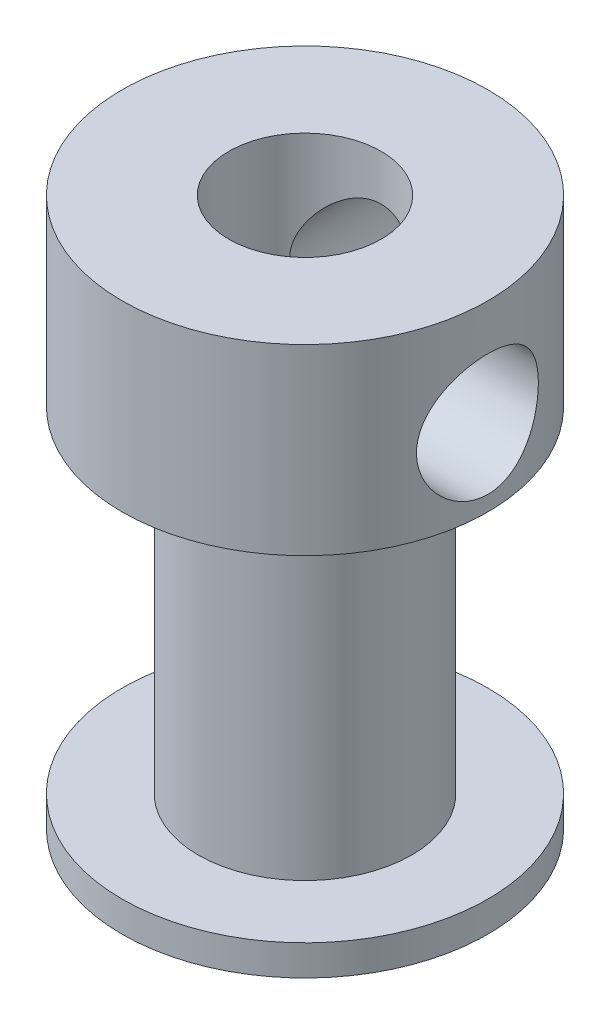
ISO-10303-21;
HEADER;
FILE_DESCRIPTION(('STEP AP214'),'2;1');
FILE_NAME('part.step','',(''),(''),'','','');
FILE_SCHEMA(('AUTOMOTIVE_DESIGN { 1 0 10303 214 1 1 1 1 }'));
ENDSEC;
DATA;
#1=APPLICATION_CONTEXT('core data for automotive mechanical design processes');
#2=APPLICATION_PROTOCOL_DEFINITION('international standard','automotive_design',2000,#1);
#3=PRODUCT_CONTEXT('',#1,'mechanical');
#4=PRODUCT('Part','Part','',(#3));
#5=PRODUCT_RELATED_PRODUCT_CATEGORY('part','',(#4));
#6=PRODUCT_DEFINITION_FORMATION('','',#4);
#7=PRODUCT_DEFINITION_CONTEXT('part definition',#1,'design');
#8=PRODUCT_DEFINITION('design','',#6,#7);
#9=PRODUCT_DEFINITION_SHAPE('','',#8);
#10=(LENGTH_UNIT() NAMED_UNIT(*) SI_UNIT(.MILLI.,.METRE.));
#11=(NAMED_UNIT(*) PLANE_ANGLE_UNIT() SI_UNIT($,.RADIAN.));
#12=(NAMED_UNIT(*) SI_UNIT($,.STERADIAN.) SOLID_ANGLE_UNIT());
#13=UNCERTAINTY_MEASURE_WITH_UNIT(LENGTH_MEASURE(1.E-05),#10,'distance_accuracy_value','');
#14=(GEOMETRIC_REPRESENTATION_CONTEXT(3) GLOBAL_UNCERTAINTY_ASSIGNED_CONTEXT((#13)) GLOBAL_UNIT_ASSIGNED_CONTEXT((#10,
#11,#12)) REPRESENTATION_CONTEXT('',''));
#15=CARTESIAN_POINT('',(0.,0.,0.));
#16=DIRECTION('',(0.,0.,1.));
#17=DIRECTION('',(1.,0.,0.));
#18=AXIS2_PLACEMENT_3D('',#15,#16,#17);
#19=CARTESIAN_POINT('',(0.,1.,0.));
#20=DIRECTION('',(0.,-1.,0.));
#21=DIRECTION('',(0.,0.,-1.));
#22=AXIS2_PLACEMENT_3D('',#19,#20,#21);
#23=CYLINDRICAL_SURFACE('',#22,6.);
#24=CARTESIAN_POINT('',(0.,1.,0.));
#25=DIRECTION('',(0.,1.,0.));
#26=DIRECTION('',(0.,0.,1.));
#27=AXIS2_PLACEMENT_3D('',#24,#25,#26);
#28=CIRCLE('',#27,6.);
#29=CARTESIAN_POINT('',(0.,1.,6.));
#30=VERTEX_POINT('',#29);
#31=EDGE_CURVE('E124',#30,#30,#28,.T.);
#32=ORIENTED_EDGE('',*,*,#31,.F.);
#33=EDGE_LOOP('',(#32));
#34=FACE_BOUND('',#33,.T.);
#35=CARTESIAN_POINT('',(0.,0.,0.));
#36=DIRECTION('',(0.,1.,0.));
#37=DIRECTION('',(0.,0.,1.));
#38=AXIS2_PLACEMENT_3D('',#35,#36,#37);
#39=CIRCLE('',#38,6.);
#40=CARTESIAN_POINT('',(0.,0.,6.));
#41=VERTEX_POINT('',#40);
#42=EDGE_CURVE('E76',#41,#41,#39,.T.);
#43=ORIENTED_EDGE('',*,*,#42,.T.);
#44=EDGE_LOOP('',(#43));
#45=FACE_BOUND('',#44,.T.);
#46=ADVANCED_FACE('F37',(#34,#45),#23,.T.);
#47=CARTESIAN_POINT('',(0.,1.,0.));
#48=DIRECTION('',(0.,1.,0.));
#49=DIRECTION('',(0.,0.,1.));
#50=AXIS2_PLACEMENT_3D('',#47,#48,#49);
#51=PLANE('',#50);
#52=CARTESIAN_POINT('',(0.,1.,0.));
#53=DIRECTION('',(0.,1.,0.));
#54=DIRECTION('',(0.,0.,1.));
#55=AXIS2_PLACEMENT_3D('',#52,#53,#54);
#56=CIRCLE('',#55,3.5);
#57=CARTESIAN_POINT('',(0.,1.,3.5));
#58=VERTEX_POINT('',#57);
#59=EDGE_CURVE('E44',#58,#58,#56,.T.);
#60=ORIENTED_EDGE('',*,*,#59,.F.);
#61=EDGE_LOOP('',(#60));
#62=FACE_BOUND('',#61,.T.);
#63=ORIENTED_EDGE('',*,*,#31,.T.);
#64=EDGE_LOOP('',(#63));
#65=FACE_BOUND('',#64,.T.);
#66=ADVANCED_FACE('F108',(#62,#65),#51,.T.);
#67=CARTESIAN_POINT('',(0.,0.,0.));
#68=DIRECTION('',(0.,1.,0.));
#69=DIRECTION('',(0.,0.,1.));
#70=AXIS2_PLACEMENT_3D('',#67,#68,#69);
#71=PLANE('',#70);
#72=CARTESIAN_POINT('',(0.,0.,0.));
#73=DIRECTION('',(0.,1.,0.));
#74=DIRECTION('',(0.,0.,1.));
#75=AXIS2_PLACEMENT_3D('',#72,#73,#74);
#76=CIRCLE('',#75,2.5);
#77=CARTESIAN_POINT('',(0.,0.,2.5));
#78=VERTEX_POINT('',#77);
#79=EDGE_CURVE('E93',#78,#78,#76,.T.);
#80=ORIENTED_EDGE('',*,*,#79,.T.);
#81=EDGE_LOOP('',(#80));
#82=FACE_BOUND('',#81,.T.);
#83=ORIENTED_EDGE('',*,*,#42,.F.);
#84=EDGE_LOOP('',(#83));
#85=FACE_BOUND('',#84,.T.);
#86=ADVANCED_FACE('F106',(#82,#85),#71,.F.);
#87=CARTESIAN_POINT('',(0.,12.,0.));
#88=DIRECTION('',(0.,-1.,0.));
#89=DIRECTION('',(0.,0.,-1.));
#90=AXIS2_PLACEMENT_3D('',#87,#88,#89);
#91=CYLINDRICAL_SURFACE('',#90,3.5);
#92=CARTESIAN_POINT('',(0.,12.,0.));
#93=DIRECTION('',(0.,1.,0.));
#94=DIRECTION('',(0.,0.,1.));
#95=AXIS2_PLACEMENT_3D('',#92,#93,#94);
#96=CIRCLE('',#95,3.5);
#97=CARTESIAN_POINT('',(0.,12.,3.5));
#98=VERTEX_POINT('',#97);
#99=EDGE_CURVE('E127',#98,#98,#96,.T.);
#100=ORIENTED_EDGE('',*,*,#99,.F.);
#101=EDGE_LOOP('',(#100));
#102=FACE_BOUND('',#101,.T.);
#103=ORIENTED_EDGE('',*,*,#59,.T.);
#104=EDGE_LOOP('',(#103));
#105=FACE_BOUND('',#104,.T.);
#106=ADVANCED_FACE('F101',(#102,#105),#91,.T.);
#107=CARTESIAN_POINT('',(0.,14.,0.));
#108=DIRECTION('',(0.,-1.,0.));
#109=DIRECTION('',(0.,0.,-1.));
#110=AXIS2_PLACEMENT_3D('',#107,#108,#109);
#111=CYLINDRICAL_SURFACE('',#110,6.);
#112=CARTESIAN_POINT('',(6.00000000000002,12.5,0.));
#113=CARTESIAN_POINT('',(6.0000003060189,12.4999994925367,0.109126725773467));
#114=CARTESIAN_POINT('',(5.9969953901509,12.5089605322544,0.21825038907712));
#115=CARTESIAN_POINT('',(5.98530420406561,12.5444582176344,0.433283521745964));
#116=CARTESIAN_POINT('',(5.97661734404305,12.5709966878978,0.539192656237656));
#117=CARTESIAN_POINT('',(5.95450615812885,12.6406384867681,0.744665579003573));
#118=CARTESIAN_POINT('',(5.94108975461707,12.6837141249185,0.844239651772089));
#119=CARTESIAN_POINT('',(5.91088891434683,12.7850823456767,1.03474987361067));
#120=CARTESIAN_POINT('',(5.89410381335556,12.8433779300052,1.12568431391743));
#121=CARTESIAN_POINT('',(5.8582818888601,12.9756516097175,1.29948335004455));
#122=CARTESIAN_POINT('',(5.83919112927569,13.050062468521,1.38200740059664));
#123=CARTESIAN_POINT('',(5.80120629566243,13.2115343094131,1.53366538540419));
#124=CARTESIAN_POINT('',(5.78231226581098,13.298598069857,1.60279637097894));
#125=CARTESIAN_POINT('',(5.74626664954547,13.4859702303929,1.72764988445574));
#126=CARTESIAN_POINT('',(5.72918078551376,13.5865874794642,1.78292971644208));
#127=CARTESIAN_POINT('',(5.69950610837202,13.7963521889171,1.87563774775546));
#128=CARTESIAN_POINT('',(5.68691592321491,13.9054970343255,1.91307139477355));
#129=CARTESIAN_POINT('',(5.66822606538754,14.1253464429934,1.96774692301835));
#130=CARTESIAN_POINT('',(5.66192191539222,14.2358744169781,1.98562689654356));
#131=CARTESIAN_POINT('',(5.65591313259015,14.4585275083118,2.00268224666897));
#132=CARTESIAN_POINT('',(5.6562064604546,14.5706521214184,2.00186340320946));
#133=CARTESIAN_POINT('',(5.6631803001636,14.787873260888,1.98203980740686));
#134=CARTESIAN_POINT('',(5.66956831735066,14.893056805838,1.96386782633401));
#135=CARTESIAN_POINT('',(5.68753315449101,15.0987868392137,1.91121232569886));
#136=CARTESIAN_POINT('',(5.69911059568215,15.1993327708701,1.87672685318376));
#137=CARTESIAN_POINT('',(5.72635822262497,15.394825499183,1.79187811612044));
#138=CARTESIAN_POINT('',(5.74209131586234,15.4896560509391,1.74126809741455));
#139=CARTESIAN_POINT('',(5.77585117151452,15.6697418165595,1.6257782126063));
#140=CARTESIAN_POINT('',(5.79387859580927,15.7549942538668,1.56089422472803));
#141=CARTESIAN_POINT('',(5.83134658335481,15.9181831963215,1.4146986653645));
#142=CARTESIAN_POINT('',(5.85081178709685,15.9955053890181,1.33270630015264));
#143=CARTESIAN_POINT('',(5.88813876774073,16.1354625333268,1.15667913994015));
#144=CARTESIAN_POINT('',(5.90600039076135,16.198096076329,1.06264319132165));
#145=CARTESIAN_POINT('',(5.93834215875587,16.3073926004701,0.863895226092556));
#146=CARTESIAN_POINT('',(5.95278700016078,16.3538909826815,0.759086552832694));
#147=CARTESIAN_POINT('',(5.9764113428887,16.4284063479114,0.542538166729036));
#148=CARTESIAN_POINT('',(5.98559267309759,16.4564297508469,0.430800876309929));
#149=CARTESIAN_POINT('',(5.99735254142881,16.4921113320447,0.20876765905863));
#150=CARTESIAN_POINT('',(6.00020003667456,16.5005996183455,0.098619199729714));
#151=CARTESIAN_POINT('',(5.99977805389655,16.4993346528031,-0.121550139920454));
#152=CARTESIAN_POINT('',(5.99650960838725,16.4895844800403,-0.23157103863928));
#153=CARTESIAN_POINT('',(5.98440049434209,16.4527761845281,-0.44503973260849));
#154=CARTESIAN_POINT('',(5.97572397422385,16.426227587901,-0.548585613669666));
#155=CARTESIAN_POINT('',(5.9538369366014,16.3572131110665,-0.749711917159126));
#156=CARTESIAN_POINT('',(5.94062584093351,16.3147452010644,-0.847291577017192));
#157=CARTESIAN_POINT('',(5.9105786257458,16.2138591363184,-1.03657659278653));
#158=CARTESIAN_POINT('',(5.89365629511573,16.1550508134337,-1.12805991843427));
#159=CARTESIAN_POINT('',(5.85810507832526,16.023611699973,-1.30012966027115));
#160=CARTESIAN_POINT('',(5.83947567187656,15.9509766879365,-1.38071273559113));
#161=CARTESIAN_POINT('',(5.8015369596089,15.7900424979868,-1.53250501561258));
#162=CARTESIAN_POINT('',(5.78223522174857,15.7011815461463,-1.60312193849152));
#163=CARTESIAN_POINT('',(5.74599946589418,15.5124568643782,-1.72851504464713));
#164=CARTESIAN_POINT('',(5.72906546764005,15.4125930427318,-1.78329109586201));
#165=CARTESIAN_POINT('',(5.69964783582768,15.2046539694202,-1.8751938608327));
#166=CARTESIAN_POINT('',(5.68715521585958,15.0965958416625,-1.91235626433002));
#167=CARTESIAN_POINT('',(5.668216646129,14.8752426999117,-1.96778933351869));
#168=CARTESIAN_POINT('',(5.6617679724728,14.7619500691913,-1.98606850990786));
#169=CARTESIAN_POINT('',(5.65595717748355,14.5396058079182,-2.00255256495467));
#170=CARTESIAN_POINT('',(5.65624800514831,14.4306353194264,-2.00174051461678));
#171=CARTESIAN_POINT('',(5.66302539647736,14.2144698501559,-1.98248458689737));
#172=CARTESIAN_POINT('',(5.66951159138724,14.1072747640898,-1.96404175891715));
#173=CARTESIAN_POINT('',(5.68769048609784,13.8997286739951,-1.91074362625867));
#174=CARTESIAN_POINT('',(5.69928196044956,13.799286349991,-1.87620669203101));
#175=CARTESIAN_POINT('',(5.72632797636938,13.6055451861235,-1.79195873151947));
#176=CARTESIAN_POINT('',(5.74178337526787,13.512247937624,-1.74224433710759));
#177=CARTESIAN_POINT('',(5.77565658452093,13.3310326601542,-1.62652138516684));
#178=CARTESIAN_POINT('',(5.79417423284275,13.2435269962032,-1.55989648552914));
#179=CARTESIAN_POINT('',(5.83166712566506,13.0806203732316,-1.41328576627128));
#180=CARTESIAN_POINT('',(5.85064249824745,13.0052228486239,-1.33329616890294));
#181=CARTESIAN_POINT('',(5.88780061051089,12.8657111754216,-1.15848311384136));
#182=CARTESIAN_POINT('',(5.90592363602514,12.802151304498,-1.06320302699944));
#183=CARTESIAN_POINT('',(5.93851982345225,12.6920191422987,-0.862714714813228));
#184=CARTESIAN_POINT('',(5.9529939181586,12.6454425081559,-0.757509036264676));
#185=CARTESIAN_POINT('',(5.97611030137084,12.5725567350227,-0.54498729440193));
#186=CARTESIAN_POINT('',(5.98498424845045,12.5454350674732,-0.437975515352795));
#187=CARTESIAN_POINT('',(5.99692814128444,12.5091594386457,-0.220640832020472));
#188=CARTESIAN_POINT('',(5.99999969063812,12.5000005130069,-0.110318851137471));
#189=CARTESIAN_POINT('',(6.00000000000002,12.5,0.));
#190=B_SPLINE_CURVE_WITH_KNOTS('',3,(#112,#113,#114,#115,#116,#117,#118,#119,#120,#121,#122,
#123,#124,#125,#126,#127,#128,#129,#130,#131,#132,#133,#134,#135,#136,#137,#138,#139,#140,#141,
#142,#143,#144,#145,#146,#147,#148,#149,#150,#151,#152,#153,#154,#155,#156,#157,#158,#159,#160,
#161,#162,#163,#164,#165,#166,#167,#168,#169,#170,#171,#172,#173,#174,#175,#176,#177,#178,#179,
#180,#181,#182,#183,#184,#185,#186,#187,#188,#189),.UNSPECIFIED.,.T.,.F.,(4,2,2,2,2,2,2,2,2,2,2,
2,2,2,2,2,2,2,2,2,2,2,2,2,2,2,2,2,2,2,2,2,2,2,2,2,2,2,4),(0.,0.326974212052021,
0.653982370535041,0.980445345740548,1.3069727555982,1.64369368565512,1.9804886657506,
2.32696769646941,2.67334089385667,3.0080385148368,3.34263267974971,3.66193653102561,
3.98127861710964,4.30576342310261,4.63034205116414,4.97186611622734,5.31342291933237,
5.65836811300715,6.00319337754417,6.33307166350339,6.66289426328353,6.98316315956427,
7.30347290568208,7.63220799687473,7.96104361643783,8.30482045761504,8.64860016469994,
8.99168027653541,9.33460569411681,9.65991332128517,9.98520158702751,10.3043117416084,
10.6234927635196,10.9566013338361,11.2898042224756,11.635993216702,11.9820936230491,
12.3127311674763,12.6432773207628),.UNSPECIFIED.);
#191=CARTESIAN_POINT('',(6.00000000000002,12.5,0.));
#192=VERTEX_POINT('',#191);
#193=EDGE_CURVE('E60',#192,#192,#190,.T.);
#194=ORIENTED_EDGE('',*,*,#193,.T.);
#195=EDGE_LOOP('',(#194));
#196=FACE_BOUND('',#195,.T.);
#197=CARTESIAN_POINT('',(0.,16.5,-6.));
#198=CARTESIAN_POINT('',(-0.109126725773446,16.5000005074633,-6.00000030601888));
#199=CARTESIAN_POINT('',(-0.2182503890771,16.4910394677456,-5.9969953901509));
#200=CARTESIAN_POINT('',(-0.433283521745945,16.4555417823656,-5.98530420406562));
#201=CARTESIAN_POINT('',(-0.539192656237636,16.4290033121022,-5.97661734404305));
#202=CARTESIAN_POINT('',(-0.744665579003553,16.3593615132319,-5.95450615812885));
#203=CARTESIAN_POINT('',(-0.844239651772069,16.3162858750815,-5.94108975461707));
#204=CARTESIAN_POINT('',(-1.03474987361065,16.2149176543233,-5.91088891434684));
#205=CARTESIAN_POINT('',(-1.12568431391741,16.1566220699948,-5.89410381335556));
#206=CARTESIAN_POINT('',(-1.29948335004453,16.0243483902825,-5.8582818888601));
#207=CARTESIAN_POINT('',(-1.38200740059662,15.949937531479,-5.8391911292757));
#208=CARTESIAN_POINT('',(-1.53366538540417,15.7884656905869,-5.80120629566243));
#209=CARTESIAN_POINT('',(-1.60279637097893,15.701401930143,-5.78231226581098));
#210=CARTESIAN_POINT('',(-1.72764988445572,15.5140297696071,-5.74626664954548));
#211=CARTESIAN_POINT('',(-1.78292971644206,15.4134125205358,-5.72918078551377));
#212=CARTESIAN_POINT('',(-1.87563774775544,15.2036478110829,-5.69950610837202));
#213=CARTESIAN_POINT('',(-1.91307139477353,15.0945029656745,-5.68691592321491));
#214=CARTESIAN_POINT('',(-1.96774692301833,14.8746535570066,-5.66822606538755));
#215=CARTESIAN_POINT('',(-1.98562689654354,14.7641255830219,-5.66192191539223));
#216=CARTESIAN_POINT('',(-2.00268224666896,14.5414724916882,-5.65591313259015));
#217=CARTESIAN_POINT('',(-2.00186340320944,14.4293478785816,-5.6562064604546));
#218=CARTESIAN_POINT('',(-1.98203980740684,14.212126739112,-5.66318030016361));
#219=CARTESIAN_POINT('',(-1.96386782633399,14.106943194162,-5.66956831735066));
#220=CARTESIAN_POINT('',(-1.91121232569884,13.9012131607863,-5.68753315449102));
#221=CARTESIAN_POINT('',(-1.87672685318374,13.8006672291299,-5.69911059568215));
#222=CARTESIAN_POINT('',(-1.79187811612042,13.605174500817,-5.72635822262498));
#223=CARTESIAN_POINT('',(-1.74126809741453,13.510343949061,-5.74209131586235));
#224=CARTESIAN_POINT('',(-1.62577821260628,13.3302581834406,-5.77585117151453));
#225=CARTESIAN_POINT('',(-1.56089422472801,13.2450057461332,-5.79387859580927));
#226=CARTESIAN_POINT('',(-1.41469866536448,13.0818168036785,-5.83134658335482));
#227=CARTESIAN_POINT('',(-1.33270630015262,13.0044946109819,-5.85081178709686));
#228=CARTESIAN_POINT('',(-1.15667913994013,12.8645374666732,-5.88813876774074));
#229=CARTESIAN_POINT('',(-1.06264319132163,12.801903923671,-5.90600039076135));
#230=CARTESIAN_POINT('',(-0.863895226092534,12.6926073995299,-5.93834215875588));
#231=CARTESIAN_POINT('',(-0.759086552832671,12.6461090173185,-5.95278700016079));
#232=CARTESIAN_POINT('',(-0.542538166729013,12.5715936520886,-5.9764113428887));
#233=CARTESIAN_POINT('',(-0.430800876309905,12.5435702491531,-5.98559267309759));
#234=CARTESIAN_POINT('',(-0.208767659058606,12.5078886679553,-5.99735254142881));
#235=CARTESIAN_POINT('',(-0.0986191997296905,12.4994003816545,-6.00020003667456));
#236=CARTESIAN_POINT('',(0.121550139920477,12.5006653471969,-5.99977805389655));
#237=CARTESIAN_POINT('',(0.231571038639302,12.5104155199598,-5.99650960838725));
#238=CARTESIAN_POINT('',(0.445039732608512,12.5472238154719,-5.98440049434209));
#239=CARTESIAN_POINT('',(0.548585613669688,12.573772412099,-5.97572397422385));
#240=CARTESIAN_POINT('',(0.749711917159148,12.6427868889335,-5.9538369366014));
#241=CARTESIAN_POINT('',(0.847291577017214,12.6852547989356,-5.9406258409335));
#242=CARTESIAN_POINT('',(1.03657659278655,12.7861408636816,-5.9105786257458));
#243=CARTESIAN_POINT('',(1.12805991843429,12.8449491865663,-5.89365629511572));
#244=CARTESIAN_POINT('',(1.30012966027117,12.976388300027,-5.85810507832525));
#245=CARTESIAN_POINT('',(1.38071273559115,13.0490233120635,-5.83947567187655));
#246=CARTESIAN_POINT('',(1.5325050156126,13.2099575020132,-5.8015369596089));
#247=CARTESIAN_POINT('',(1.60312193849154,13.2988184538537,-5.78223522174856));
#248=CARTESIAN_POINT('',(1.72851504464715,13.4875431356218,-5.74599946589418));
#249=CARTESIAN_POINT('',(1.78329109586203,13.5874069572682,-5.72906546764005));
#250=CARTESIAN_POINT('',(1.87519386083272,13.7953460305798,-5.69964783582767));
#251=CARTESIAN_POINT('',(1.91235626433004,13.9034041583375,-5.68715521585958));
#252=CARTESIAN_POINT('',(1.96778933351871,14.1247573000883,-5.66821664612899));
#253=CARTESIAN_POINT('',(1.98606850990788,14.2380499308087,-5.66176797247279));
#254=CARTESIAN_POINT('',(2.00255256495468,14.4603941920818,-5.65595717748355));
#255=CARTESIAN_POINT('',(2.0017405146168,14.5693646805737,-5.65624800514831));
#256=CARTESIAN_POINT('',(1.98248458689739,14.7855301498441,-5.66302539647735));
#257=CARTESIAN_POINT('',(1.96404175891717,14.8927252359102,-5.66951159138724));
#258=CARTESIAN_POINT('',(1.91074362625869,15.1002713260049,-5.68769048609784));
#259=CARTESIAN_POINT('',(1.87620669203103,15.200713650009,-5.69928196044955));
#260=CARTESIAN_POINT('',(1.79195873151949,15.3944548138765,-5.72632797636937));
#261=CARTESIAN_POINT('',(1.74224433710761,15.487752062376,-5.74178337526786));
#262=CARTESIAN_POINT('',(1.62652138516686,15.6689673398458,-5.77565658452093));
#263=CARTESIAN_POINT('',(1.55989648552916,15.7564730037968,-5.79417423284274));
#264=CARTESIAN_POINT('',(1.4132857662713,15.9193796267684,-5.83166712566506));
#265=CARTESIAN_POINT('',(1.33329616890296,15.9947771513762,-5.85064249824745));
#266=CARTESIAN_POINT('',(1.15848311384138,16.1342888245784,-5.88780061051089));
#267=CARTESIAN_POINT('',(1.06320302699946,16.197848695502,-5.90592363602514));
#268=CARTESIAN_POINT('',(0.86271471481325,16.3079808577013,-5.93851982345224));
#269=CARTESIAN_POINT('',(0.757509036264698,16.3545574918441,-5.9529939181586));
#270=CARTESIAN_POINT('',(0.544987294401952,16.4274432649773,-5.97611030137084));
#271=CARTESIAN_POINT('',(0.437975515352818,16.4545649325268,-5.98498424845046));
#272=CARTESIAN_POINT('',(0.220640832020495,16.4908405613543,-5.99692814128444));
#273=CARTESIAN_POINT('',(0.110318851137493,16.4999994869931,-5.9999996906381));
#274=CARTESIAN_POINT('',(0.,16.5,-6.));
#275=B_SPLINE_CURVE_WITH_KNOTS('',3,(#197,#198,#199,#200,#201,#202,#203,#204,#205,#206,#207,
#208,#209,#210,#211,#212,#213,#214,#215,#216,#217,#218,#219,#220,#221,#222,#223,#224,#225,#226,
#227,#228,#229,#230,#231,#232,#233,#234,#235,#236,#237,#238,#239,#240,#241,#242,#243,#244,#245,
#246,#247,#248,#249,#250,#251,#252,#253,#254,#255,#256,#257,#258,#259,#260,#261,#262,#263,#264,
#265,#266,#267,#268,#269,#270,#271,#272,#273,#274),.UNSPECIFIED.,.T.,.F.,(4,2,2,2,2,2,2,2,2,2,2,
2,2,2,2,2,2,2,2,2,2,2,2,2,2,2,2,2,2,2,2,2,2,2,2,2,2,2,4),(0.,0.326974212052022,
0.653982370535042,0.980445345740548,1.3069727555982,1.64369368565512,1.98048866575061,
2.32696769646941,2.67334089385667,3.00803851483681,3.34263267974971,3.66193653102561,
3.98127861710964,4.30576342310261,4.63034205116415,4.97186611622734,5.31342291933237,
5.65836811300716,6.00319337754417,6.3330716635034,6.66289426328354,6.98316315956427,
7.30347290568208,7.63220799687473,7.96104361643783,8.30482045761504,8.64860016469994,
8.99168027653542,9.33460569411681,9.65991332128518,9.98520158702751,10.3043117416084,
10.6234927635196,10.9566013338361,11.2898042224756,11.635993216702,11.9820936230491,
12.3127311674763,12.6432773207628),.UNSPECIFIED.);
#276=CARTESIAN_POINT('',(0.,16.5,-6.));
#277=VERTEX_POINT('',#276);
#278=EDGE_CURVE('E64',#277,#277,#275,.T.);
#279=ORIENTED_EDGE('',*,*,#278,.T.);
#280=EDGE_LOOP('',(#279));
#281=FACE_BOUND('',#280,.T.);
#282=CARTESIAN_POINT('',(0.,12.,0.));
#283=DIRECTION('',(0.,1.,0.));
#284=DIRECTION('',(0.,0.,1.));
#285=AXIS2_PLACEMENT_3D('',#282,#283,#284);
#286=CIRCLE('',#285,6.);
#287=CARTESIAN_POINT('',(0.,12.,6.));
#288=VERTEX_POINT('',#287);
#289=EDGE_CURVE('E129',#288,#288,#286,.T.);
#290=ORIENTED_EDGE('',*,*,#289,.T.);
#291=EDGE_LOOP('',(#290));
#292=FACE_BOUND('',#291,.T.);
#293=CARTESIAN_POINT('',(0.,18.,0.));
#294=DIRECTION('',(0.,1.,0.));
#295=DIRECTION('',(0.,0.,1.));
#296=AXIS2_PLACEMENT_3D('',#293,#294,#295);
#297=CIRCLE('',#296,6.);
#298=CARTESIAN_POINT('',(0.,18.,6.));
#299=VERTEX_POINT('',#298);
#300=EDGE_CURVE('E134',#299,#299,#297,.T.);
#301=ORIENTED_EDGE('',*,*,#300,.F.);
#302=EDGE_LOOP('',(#301));
#303=FACE_BOUND('',#302,.T.);
#304=ADVANCED_FACE('F95',(#196,#281,#292,#303),#111,.T.);
#305=CARTESIAN_POINT('',(0.,12.,0.));
#306=DIRECTION('',(0.,1.,0.));
#307=DIRECTION('',(0.,0.,1.));
#308=AXIS2_PLACEMENT_3D('',#305,#306,#307);
#309=PLANE('',#308);
#310=ORIENTED_EDGE('',*,*,#99,.T.);
#311=EDGE_LOOP('',(#310));
#312=FACE_BOUND('',#311,.T.);
#313=ORIENTED_EDGE('',*,*,#289,.F.);
#314=EDGE_LOOP('',(#313));
#315=FACE_BOUND('',#314,.T.);
#316=ADVANCED_FACE('F100',(#312,#315),#309,.F.);
#317=CARTESIAN_POINT('',(0.,18.,0.));
#318=DIRECTION('',(0.,1.,0.));
#319=DIRECTION('',(0.,0.,1.));
#320=AXIS2_PLACEMENT_3D('',#317,#318,#319);
#321=PLANE('',#320);
#322=CARTESIAN_POINT('',(0.,18.,0.));
#323=DIRECTION('',(0.,1.,0.));
#324=DIRECTION('',(0.,0.,1.));
#325=AXIS2_PLACEMENT_3D('',#322,#323,#324);
#326=CIRCLE('',#325,2.5);
#327=CARTESIAN_POINT('',(0.,18.,2.5));
#328=VERTEX_POINT('',#327);
#329=EDGE_CURVE('E66',#328,#328,#326,.T.);
#330=ORIENTED_EDGE('',*,*,#329,.F.);
#331=EDGE_LOOP('',(#330));
#332=FACE_BOUND('',#331,.T.);
#333=ORIENTED_EDGE('',*,*,#300,.T.);
#334=EDGE_LOOP('',(#333));
#335=FACE_BOUND('',#334,.T.);
#336=ADVANCED_FACE('F148',(#332,#335),#321,.T.);
#337=CARTESIAN_POINT('',(0.,0.,0.));
#338=DIRECTION('',(0.,1.,0.));
#339=DIRECTION('',(0.,0.,1.));
#340=AXIS2_PLACEMENT_3D('',#337,#338,#339);
#341=CYLINDRICAL_SURFACE('',#340,2.5);
#342=CARTESIAN_POINT('',(2.,14.5,-1.5));
#343=CARTESIAN_POINT('',(1.9999899563842,14.4249189826114,-1.5000227575991));
#344=CARTESIAN_POINT('',(1.99572243014959,14.3497210739064,-1.50575588676017));
#345=CARTESIAN_POINT('',(1.97904350434638,14.2016854705704,-1.52759797098302));
#346=CARTESIAN_POINT('',(1.96660415938923,14.1288567781879,-1.54374252679463));
#347=CARTESIAN_POINT('',(1.9288828901246,13.9623945804915,-1.59078313764401));
#348=CARTESIAN_POINT('',(1.90063587852784,13.8703574929005,-1.62485949442394));
#349=CARTESIAN_POINT('',(1.83286412912235,13.6940318598387,-1.70094533012843));
#350=CARTESIAN_POINT('',(1.79330760683741,13.6097660503329,-1.74297705283045));
#351=CARTESIAN_POINT('',(1.68777756612173,13.4196603432195,-1.84624966659378));
#352=CARTESIAN_POINT('',(1.61742363711761,13.3170334258727,-1.90894188114929));
#353=CARTESIAN_POINT('',(1.4586193506474,13.1260231647878,-2.03287996747903));
#354=CARTESIAN_POINT('',(1.37018407682201,13.0376280578861,-2.0941269976447));
#355=CARTESIAN_POINT('',(1.19476026278806,12.8928950804225,-2.1979067439451));
#356=CARTESIAN_POINT('',(1.11093376146689,12.8336737173159,-2.24174680788007));
#357=CARTESIAN_POINT('',(0.932444755507563,12.7276340400337,-2.32165152523267));
#358=CARTESIAN_POINT('',(0.837799422094951,12.6807964517991,-2.35772824500368));
#359=CARTESIAN_POINT('',(0.655317082222548,12.6082870394193,-2.41415644696378));
#360=CARTESIAN_POINT('',(0.568853585755694,12.5804174354239,-2.43610736091393));
#361=CARTESIAN_POINT('',(0.39118805292199,12.536501304746,-2.47085912284979));
#362=CARTESIAN_POINT('',(0.299988637312622,12.52044831209,-2.48366497483986));
#363=CARTESIAN_POINT('',(0.115048335136527,12.5011419067099,-2.49907968883617));
#364=CARTESIAN_POINT('',(0.0212997713727005,12.4979328073114,-2.50165324772141));
#365=CARTESIAN_POINT('',(-0.165416366428142,12.5046642348722,-2.49626936144757));
#366=CARTESIAN_POINT('',(-0.258383904122233,12.5146053703685,-2.48831142893578));
#367=CARTESIAN_POINT('',(-0.435683568436099,12.546067986313,-2.4632836571348));
#368=CARTESIAN_POINT('',(-0.5202101889175,12.5669288169561,-2.44673404857181));
#369=CARTESIAN_POINT('',(-0.684171862172427,12.6186952342522,-2.40604493660584));
#370=CARTESIAN_POINT('',(-0.76360562412977,12.6496033554976,-2.38190351809567));
#371=CARTESIAN_POINT('',(-0.923527318234434,12.7236006985885,-2.32486221996811));
#372=CARTESIAN_POINT('',(-1.00337969293305,12.7675765160147,-2.29134265660255));
#373=CARTESIAN_POINT('',(-1.15470891362336,12.8645378595917,-2.21894043646479));
#374=CARTESIAN_POINT('',(-1.22618103296473,12.9175284293631,-2.18005477975511));
#375=CARTESIAN_POINT('',(-1.37426521356107,13.0430618687988,-2.09053510980241));
#376=CARTESIAN_POINT('',(-1.44890108738507,13.1173836142049,-2.03913144290366));
#377=CARTESIAN_POINT('',(-1.58538384993671,13.2762559036507,-1.9349237792571));
#378=CARTESIAN_POINT('',(-1.6472149443604,13.3608188786743,-1.88211814269102));
#379=CARTESIAN_POINT('',(-1.75228528490804,13.5312201958179,-1.78441317626436));
#380=CARTESIAN_POINT('',(-1.79674173995946,13.6161509405137,-1.73924224553799));
#381=CARTESIAN_POINT('',(-1.87389106987979,13.7943664663345,-1.65582105773209));
#382=CARTESIAN_POINT('',(-1.90660965872838,13.8876324203376,-1.61755576516689));
#383=CARTESIAN_POINT('',(-1.95062199735974,14.0527916040278,-1.56393805143324));
#384=CARTESIAN_POINT('',(-1.96540293714784,14.1226128308979,-1.54515601955456));
#385=CARTESIAN_POINT('',(-1.98746978122375,14.2651802059542,-1.51667304681101));
#386=CARTESIAN_POINT('',(-1.99477239579985,14.3379194539107,-1.50695186390373));
#387=CARTESIAN_POINT('',(-2.0012999442642,14.4848633779274,-1.49827790293909));
#388=CARTESIAN_POINT('',(-2.00047806264257,14.5590740850574,-1.49938753445573));
#389=CARTESIAN_POINT('',(-1.99072610261057,14.7060473250374,-1.51230456185752));
#390=CARTESIAN_POINT('',(-1.98178458332099,14.7788076663875,-1.52412705251965));
#391=CARTESIAN_POINT('',(-1.95331430449204,14.9390632026618,-1.56051508430773));
#392=CARTESIAN_POINT('',(-1.9316709289088,15.0255982681308,-1.58755721486228));
#393=CARTESIAN_POINT('',(-1.87841388450525,15.1922908660855,-1.65022809339808));
#394=CARTESIAN_POINT('',(-1.84677049067316,15.2724284809031,-1.6858823654909));
#395=CARTESIAN_POINT('',(-1.75807608919816,15.4615289293493,-1.77903249993889));
#396=CARTESIAN_POINT('',(-1.69602510944931,15.5668953343252,-1.83905564347523));
#397=CARTESIAN_POINT('',(-1.55438039564658,15.764384149242,-1.96026853157683));
#398=CARTESIAN_POINT('',(-1.47476601547362,15.8564907596835,-2.0214595710443));
#399=CARTESIAN_POINT('',(-1.29702304107541,16.027462807345,-2.13993299259158));
#400=CARTESIAN_POINT('',(-1.19864860522963,16.1061226291131,-2.19714788259661));
#401=CARTESIAN_POINT('',(-0.984970277741321,16.2452665274442,-2.30083046289374));
#402=CARTESIAN_POINT('',(-0.869723203455193,16.3058096056706,-2.34733292440641));
#403=CARTESIAN_POINT('',(-0.664531994140974,16.3884905874669,-2.41163161860483));
#404=CARTESIAN_POINT('',(-0.578408265123336,16.4167173769741,-2.43384921549886));
#405=CARTESIAN_POINT('',(-0.401365381235634,16.461432134964,-2.46921550391513));
#406=CARTESIAN_POINT('',(-0.310449944179062,16.4779290645406,-2.48237111815073));
#407=CARTESIAN_POINT('',(-0.125961358052305,16.4981928241047,-2.49854699723995));
#408=CARTESIAN_POINT('',(-0.0323797561454507,16.5019132050583,-2.50153028039159));
#409=CARTESIAN_POINT('',(0.154129494971553,16.4962334907348,-2.4969871999336));
#410=CARTESIAN_POINT('',(0.247057097671188,16.4868324715917,-2.48946009629711));
#411=CARTESIAN_POINT('',(0.424484983307844,16.4563964529088,-2.46524008405095));
#412=CARTESIAN_POINT('',(0.509170159101615,16.4360106685972,-2.44905900306101));
#413=CARTESIAN_POINT('',(0.673520542356746,16.3851465786865,-2.4090520196301));
#414=CARTESIAN_POINT('',(0.753184443303528,16.354665659174,-2.3852241372675));
#415=CARTESIAN_POINT('',(0.91338359185187,16.2816254556074,-2.32886203207213));
#416=CARTESIAN_POINT('',(0.993310088153974,16.238206157889,-2.29572397002092));
#417=CARTESIAN_POINT('',(1.14486396126306,16.1423576629054,-2.22403396009593));
#418=CARTESIAN_POINT('',(1.21648689776308,16.0899236819315,-2.18547913977515));
#419=CARTESIAN_POINT('',(1.36488223995398,15.9657037869963,-2.0966685242987));
#420=CARTESIAN_POINT('',(1.43970803793641,15.8921535866846,-2.04563299169992));
#421=CARTESIAN_POINT('',(1.57669353079991,15.7348830744766,-1.94201312920059));
#422=CARTESIAN_POINT('',(1.63883728583053,15.6511501723947,-1.88942694411833));
#423=CARTESIAN_POINT('',(1.7455126136634,15.4810424554704,-1.79109125321811));
#424=CARTESIAN_POINT('',(1.79106140064659,15.3954274787839,-1.74513263017547));
#425=CARTESIAN_POINT('',(1.87016304685231,15.2156081117486,-1.66007449903139));
#426=CARTESIAN_POINT('',(1.90373836359645,15.1214202219623,-1.6209622208173));
#427=CARTESIAN_POINT('',(1.94914139922438,14.9538606732473,-1.56580101941138));
#428=CARTESIAN_POINT('',(1.96446470848963,14.8825804555928,-1.54635220628733));
#429=CARTESIAN_POINT('',(1.98726282623962,14.7369757290291,-1.51695472225641));
#430=CARTESIAN_POINT('',(1.99476751139893,14.6626639447221,-1.50696990066825));
#431=CARTESIAN_POINT('',(1.99935742227831,14.5586747856577,-1.50085460132402));
#432=CARTESIAN_POINT('',(2.00000392566845,14.5293463217565,-1.49999110491774));
#433=CARTESIAN_POINT('',(2.,14.5,-1.5));
#434=B_SPLINE_CURVE_WITH_KNOTS('',3,(#342,#343,#344,#345,#346,#347,#348,#349,#350,#351,#352,
#353,#354,#355,#356,#357,#358,#359,#360,#361,#362,#363,#364,#365,#366,#367,#368,#369,#370,#371,
#372,#373,#374,#375,#376,#377,#378,#379,#380,#381,#382,#383,#384,#385,#386,#387,#388,#389,#390,
#391,#392,#393,#394,#395,#396,#397,#398,#399,#400,#401,#402,#403,#404,#405,#406,#407,#408,#409,
#410,#411,#412,#413,#414,#415,#416,#417,#418,#419,#420,#421,#422,#423,#424,#425,#426,#427,#428,
#429,#430,#431,#432,#433),.UNSPECIFIED.,.T.,.F.,(4,2,2,2,2,2,2,2,2,2,2,2,2,2,2,2,2,2,2,2,2,2,2,
2,2,2,2,2,2,2,2,2,2,2,2,2,2,2,2,2,2,2,2,2,2,4),(0.,0.225140818813291,0.451055593895016,
0.755714384660878,1.06123795594964,1.47720804611674,1.8928325353688,2.22639303179097,
2.55943127851025,2.83862094435178,3.11765772560939,3.39765639927928,3.67766803055209,
3.94241917501297,4.20723715914626,4.49756510688428,4.78805602626153,5.13841226546405,
5.48919811771067,5.80619193384967,6.12248701337037,6.34307726284838,6.56317352160417,
6.78453876949456,7.00621641426759,7.28428560377195,7.56318925297414,7.96975811975667,
8.37680748728572,8.78961174948154,9.20105660259845,9.47985927613152,9.75844872724253,
10.0380499218877,10.3176708039936,10.5823344198312,10.8470666181456,11.1364335884203,
11.4259545900794,11.7747351905783,12.1239515037794,12.4449574092071,12.7653580273016,
12.9909138326702,13.2156045429056,13.3036035490356),.UNSPECIFIED.);
#435=CARTESIAN_POINT('',(1.76776695296637,13.5645856533065,-1.76776695296637));
#436=VERTEX_POINT('',#435);
#437=CARTESIAN_POINT('',(1.76776695296637,15.4354143466935,-1.76776695296637));
#438=VERTEX_POINT('',#437);
#439=EDGE_CURVE('E59',#436,#438,#434,.T.);
#440=ORIENTED_EDGE('',*,*,#439,.T.);
#441=CARTESIAN_POINT('',(1.49999999999999,14.5,2.00000000000001));
#442=CARTESIAN_POINT('',(1.50002275759909,14.4249189826114,1.9999899563842));
#443=CARTESIAN_POINT('',(1.50575588676016,14.3497210739064,1.99572243014959));
#444=CARTESIAN_POINT('',(1.52759797098301,14.2016854705704,1.97904350434639));
#445=CARTESIAN_POINT('',(1.54374252679463,14.1288567781879,1.96660415938923));
#446=CARTESIAN_POINT('',(1.590783137644,13.9623945804915,1.9288828901246));
#447=CARTESIAN_POINT('',(1.62485949442394,13.8703574929005,1.90063587852784));
#448=CARTESIAN_POINT('',(1.70094533012842,13.6940318598387,1.83286412912235));
#449=CARTESIAN_POINT('',(1.74297705283045,13.6097660503329,1.79330760683741));
#450=CARTESIAN_POINT('',(1.84624966659377,13.4196603432195,1.68777756612173));
#451=CARTESIAN_POINT('',(1.90894188114929,13.3170334258727,1.61742363711761));
#452=CARTESIAN_POINT('',(2.03287996747902,13.1260231647878,1.4586193506474));
#453=CARTESIAN_POINT('',(2.0941269976447,13.0376280578861,1.37018407682201));
#454=CARTESIAN_POINT('',(2.1979067439451,12.8928950804225,1.19476026278807));
#455=CARTESIAN_POINT('',(2.24174680788007,12.8336737173159,1.1109337614669));
#456=CARTESIAN_POINT('',(2.32165152523267,12.7276340400337,0.932444755507572));
#457=CARTESIAN_POINT('',(2.35772824500367,12.6807964517991,0.837799422094959));
#458=CARTESIAN_POINT('',(2.41415644696378,12.6082870394193,0.655317082222556));
#459=CARTESIAN_POINT('',(2.43610736091392,12.5804174354239,0.568853585755702));
#460=CARTESIAN_POINT('',(2.47085912284979,12.536501304746,0.391188052921998));
#461=CARTESIAN_POINT('',(2.48366497483986,12.52044831209,0.29998863731263));
#462=CARTESIAN_POINT('',(2.49907968883617,12.5011419067099,0.115048335136535));
#463=CARTESIAN_POINT('',(2.50165324772141,12.4979328073114,0.0212997713727083));
#464=CARTESIAN_POINT('',(2.49626936144757,12.5046642348722,-0.165416366428134));
#465=CARTESIAN_POINT('',(2.48831142893578,12.5146053703685,-0.258383904122226));
#466=CARTESIAN_POINT('',(2.4632836571348,12.546067986313,-0.435683568436091));
#467=CARTESIAN_POINT('',(2.44673404857181,12.5669288169561,-0.520210188917492));
#468=CARTESIAN_POINT('',(2.40604493660584,12.6186952342522,-0.684171862172419));
#469=CARTESIAN_POINT('',(2.38190351809567,12.6496033554976,-0.763605624129763));
#470=CARTESIAN_POINT('',(2.32486221996811,12.7236006985885,-0.923527318234425));
#471=CARTESIAN_POINT('',(2.29134265660256,12.7675765160147,-1.00337969293304));
#472=CARTESIAN_POINT('',(2.2189404364648,12.8645378595917,-1.15470891362335));
#473=CARTESIAN_POINT('',(2.18005477975512,12.9175284293631,-1.22618103296472));
#474=CARTESIAN_POINT('',(2.09053510980241,13.0430618687988,-1.37426521356106));
#475=CARTESIAN_POINT('',(2.03913144290367,13.1173836142049,-1.44890108738506));
#476=CARTESIAN_POINT('',(1.93492377925711,13.2762559036507,-1.58538384993671));
#477=CARTESIAN_POINT('',(1.88211814269103,13.3608188786743,-1.6472149443604));
#478=CARTESIAN_POINT('',(1.78441317626437,13.5312201958179,-1.75228528490804));
#479=CARTESIAN_POINT('',(1.739242245538,13.6161509405137,-1.79674173995945));
#480=CARTESIAN_POINT('',(1.65582105773209,13.7943664663345,-1.87389106987978));
#481=CARTESIAN_POINT('',(1.6175557651669,13.8876324203376,-1.90660965872837));
#482=CARTESIAN_POINT('',(1.56393805143324,14.0527916040278,-1.95062199735974));
#483=CARTESIAN_POINT('',(1.54515601955457,14.1226128308979,-1.96540293714783));
#484=CARTESIAN_POINT('',(1.51667304681101,14.2651802059542,-1.98746978122375));
#485=CARTESIAN_POINT('',(1.50695186390374,14.3379194539107,-1.99477239579985));
#486=CARTESIAN_POINT('',(1.4982779029391,14.4848633779274,-2.0012999442642));
#487=CARTESIAN_POINT('',(1.49938753445573,14.5590740850574,-2.00047806264257));
#488=CARTESIAN_POINT('',(1.51230456185753,14.7060473250374,-1.99072610261057));
#489=CARTESIAN_POINT('',(1.52412705251966,14.7788076663875,-1.98178458332098));
#490=CARTESIAN_POINT('',(1.56051508430774,14.9390632026618,-1.95331430449203));
#491=CARTESIAN_POINT('',(1.58755721486229,15.0255982681308,-1.9316709289088));
#492=CARTESIAN_POINT('',(1.65022809339808,15.1922908660855,-1.87841388450525));
#493=CARTESIAN_POINT('',(1.6858823654909,15.2724284809031,-1.84677049067316));
#494=CARTESIAN_POINT('',(1.77903249993889,15.4615289293493,-1.75807608919815));
#495=CARTESIAN_POINT('',(1.83905564347524,15.5668953343252,-1.69602510944931));
#496=CARTESIAN_POINT('',(1.96026853157684,15.764384149242,-1.55438039564658));
#497=CARTESIAN_POINT('',(2.0214595710443,15.8564907596835,-1.47476601547362));
#498=CARTESIAN_POINT('',(2.13993299259158,16.027462807345,-1.29702304107541));
#499=CARTESIAN_POINT('',(2.19714788259661,16.1061226291131,-1.19864860522963));
#500=CARTESIAN_POINT('',(2.30083046289375,16.2452665274442,-0.984970277741321));
#501=CARTESIAN_POINT('',(2.34733292440641,16.3058096056706,-0.869723203455193));
#502=CARTESIAN_POINT('',(2.41163161860483,16.3884905874669,-0.664531994140975));
#503=CARTESIAN_POINT('',(2.43384921549886,16.4167173769741,-0.578408265123337));
#504=CARTESIAN_POINT('',(2.46921550391513,16.461432134964,-0.401365381235634));
#505=CARTESIAN_POINT('',(2.48237111815073,16.4779290645406,-0.310449944179062));
#506=CARTESIAN_POINT('',(2.49854699723994,16.4981928241047,-0.125961358052307));
#507=CARTESIAN_POINT('',(2.50153028039159,16.5019132050583,-0.0323797561454522));
#508=CARTESIAN_POINT('',(2.4969871999336,16.4962334907348,0.154129494971551));
#509=CARTESIAN_POINT('',(2.48946009629711,16.4868324715917,0.247057097671187));
#510=CARTESIAN_POINT('',(2.46524008405095,16.4563964529088,0.424484983307845));
#511=CARTESIAN_POINT('',(2.44905900306101,16.4360106685972,0.509170159101615));
#512=CARTESIAN_POINT('',(2.4090520196301,16.3851465786865,0.673520542356746));
#513=CARTESIAN_POINT('',(2.3852241372675,16.354665659174,0.753184443303528));
#514=CARTESIAN_POINT('',(2.32886203207213,16.2816254556074,0.91338359185187));
#515=CARTESIAN_POINT('',(2.29572397002092,16.238206157889,0.993310088153974));
#516=CARTESIAN_POINT('',(2.22403396009593,16.1423576629054,1.14486396126306));
#517=CARTESIAN_POINT('',(2.18547913977515,16.0899236819315,1.21648689776308));
#518=CARTESIAN_POINT('',(2.0966685242987,15.9657037869963,1.36488223995398));
#519=CARTESIAN_POINT('',(2.04563299169992,15.8921535866846,1.43970803793641));
#520=CARTESIAN_POINT('',(1.94201312920059,15.7348830744766,1.57669353079991));
#521=CARTESIAN_POINT('',(1.88942694411833,15.6511501723947,1.63883728583054));
#522=CARTESIAN_POINT('',(1.79109125321811,15.4810424554704,1.74551261366341));
#523=CARTESIAN_POINT('',(1.74513263017547,15.3954274787839,1.79106140064659));
#524=CARTESIAN_POINT('',(1.66007449903138,15.2156081117486,1.87016304685231));
#525=CARTESIAN_POINT('',(1.6209622208173,15.1214202219623,1.90373836359645));
#526=CARTESIAN_POINT('',(1.56580101941137,14.9538606732473,1.94914139922439));
#527=CARTESIAN_POINT('',(1.54635220628733,14.8825804555928,1.96446470848964));
#528=CARTESIAN_POINT('',(1.5169547222564,14.7369757290291,1.98726282623962));
#529=CARTESIAN_POINT('',(1.50696990066825,14.6626639447221,1.99476751139894));
#530=CARTESIAN_POINT('',(1.50085460132401,14.5586747856577,1.99935742227831));
#531=CARTESIAN_POINT('',(1.49999110491774,14.5293463217565,2.00000392566845));
#532=CARTESIAN_POINT('',(1.49999999999999,14.5,2.00000000000001));
#533=B_SPLINE_CURVE_WITH_KNOTS('',3,(#441,#442,#443,#444,#445,#446,#447,#448,#449,#450,#451,
#452,#453,#454,#455,#456,#457,#458,#459,#460,#461,#462,#463,#464,#465,#466,#467,#468,#469,#470,
#471,#472,#473,#474,#475,#476,#477,#478,#479,#480,#481,#482,#483,#484,#485,#486,#487,#488,#489,
#490,#491,#492,#493,#494,#495,#496,#497,#498,#499,#500,#501,#502,#503,#504,#505,#506,#507,#508,
#509,#510,#511,#512,#513,#514,#515,#516,#517,#518,#519,#520,#521,#522,#523,#524,#525,#526,#527,
#528,#529,#530,#531,#532),.UNSPECIFIED.,.T.,.F.,(4,2,2,2,2,2,2,2,2,2,2,2,2,2,2,2,2,2,2,2,2,2,2,
2,2,2,2,2,2,2,2,2,2,2,2,2,2,2,2,2,2,2,2,2,2,4),(0.,0.225140818813293,0.451055593895018,
0.75571438466088,1.06123795594964,1.47720804611674,1.8928325353688,2.22639303179097,
2.55943127851025,2.83862094435178,3.11765772560939,3.39765639927928,3.67766803055209,
3.94241917501297,4.20723715914625,4.49756510688428,4.78805602626153,5.13841226546405,
5.48919811771067,5.80619193384967,6.12248701337037,6.34307726284838,6.56317352160417,
6.78453876949456,7.00621641426759,7.28428560377195,7.56318925297414,7.96975811975667,
8.3768074872857,8.78961174948153,9.20105660259844,9.47985927613151,9.75844872724253,
10.0380499218877,10.3176708039936,10.5823344198312,10.8470666181456,11.1364335884202,
11.4259545900794,11.7747351905783,12.1239515037794,12.4449574092071,12.7653580273015,
12.9909138326702,13.2156045429056,13.3036035490356),.UNSPECIFIED.);
#534=EDGE_CURVE('E50',#438,#436,#533,.T.);
#535=ORIENTED_EDGE('',*,*,#534,.T.);
#536=EDGE_LOOP('',(#440,#535));
#537=FACE_BOUND('',#536,.T.);
#538=ORIENTED_EDGE('',*,*,#79,.F.);
#539=EDGE_LOOP('',(#538));
#540=FACE_BOUND('',#539,.T.);
#541=ORIENTED_EDGE('',*,*,#329,.T.);
#542=EDGE_LOOP('',(#541));
#543=FACE_BOUND('',#542,.T.);
#544=ADVANCED_FACE('F57',(#537,#540,#543),#341,.F.);
#545=CARTESIAN_POINT('',(0.,14.5,-6.));
#546=DIRECTION('',(0.,0.,1.));
#547=DIRECTION('',(1.,0.,0.));
#548=AXIS2_PLACEMENT_3D('',#545,#546,#547);
#549=CYLINDRICAL_SURFACE('',#548,2.);
#550=ORIENTED_EDGE('',*,*,#439,.F.);
#551=CARTESIAN_POINT('',(0.,14.5,0.));
#552=DIRECTION('',(0.707106781186546,0.,0.707106781186549));
#553=DIRECTION('',(-0.707106781186549,0.,0.707106781186546));
#554=AXIS2_PLACEMENT_3D('',#551,#552,#553);
#555=ELLIPSE('',#554,2.82842712474619,2.);
#556=EDGE_CURVE('E11',#436,#438,#555,.T.);
#557=ORIENTED_EDGE('',*,*,#556,.T.);
#558=EDGE_LOOP('',(#550,#557));
#559=FACE_BOUND('',#558,.T.);
#560=ORIENTED_EDGE('',*,*,#278,.F.);
#561=EDGE_LOOP('',(#560));
#562=FACE_BOUND('',#561,.T.);
#563=ADVANCED_FACE('F62',(#559,#562),#549,.F.);
#564=CARTESIAN_POINT('',(6.00000000000002,14.5,0.));
#565=DIRECTION('',(-1.,0.,0.));
#566=DIRECTION('',(0.,0.,1.));
#567=AXIS2_PLACEMENT_3D('',#564,#565,#566);
#568=CYLINDRICAL_SURFACE('',#567,2.);
#569=ORIENTED_EDGE('',*,*,#556,.F.);
#570=ORIENTED_EDGE('',*,*,#534,.F.);
#571=EDGE_LOOP('',(#569,#570));
#572=FACE_BOUND('',#571,.T.);
#573=ORIENTED_EDGE('',*,*,#193,.F.);
#574=EDGE_LOOP('',(#573));
#575=FACE_BOUND('',#574,.T.);
#576=ADVANCED_FACE('F51',(#572,#575),#568,.F.);
#577=CLOSED_SHELL('',(#46,#66,#86,#106,#304,#316,#336,#544,#563,#576));
#578=MANIFOLD_SOLID_BREP('B2',#577);
#579=ADVANCED_BREP_SHAPE_REPRESENTATION('',(#18,#578),#14);
#580=SHAPE_DEFINITION_REPRESENTATION(#9,#579);
ENDSEC;
END-ISO-10303-21;
